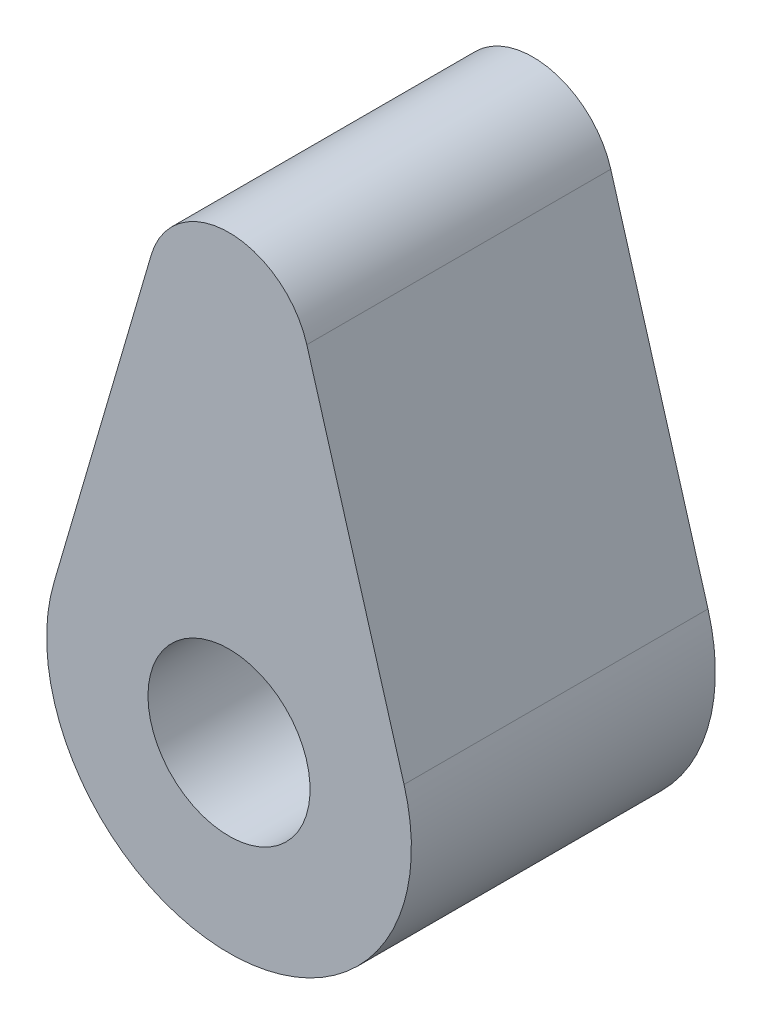
ISO-10303-21;
HEADER;
FILE_DESCRIPTION(('STEP AP214'),'2;1');
FILE_NAME('part.step','',(''),(''),'','','');
FILE_SCHEMA(('AUTOMOTIVE_DESIGN { 1 0 10303 214 1 1 1 1 }'));
ENDSEC;
DATA;
#1=APPLICATION_CONTEXT('core data for automotive mechanical design processes');
#2=APPLICATION_PROTOCOL_DEFINITION('international standard','automotive_design',2000,#1);
#3=PRODUCT_CONTEXT('',#1,'mechanical');
#4=PRODUCT('Part','Part','',(#3));
#5=PRODUCT_RELATED_PRODUCT_CATEGORY('part','',(#4));
#6=PRODUCT_DEFINITION_FORMATION('','',#4);
#7=PRODUCT_DEFINITION_CONTEXT('part definition',#1,'design');
#8=PRODUCT_DEFINITION('design','',#6,#7);
#9=PRODUCT_DEFINITION_SHAPE('','',#8);
#10=(LENGTH_UNIT() NAMED_UNIT(*) SI_UNIT(.MILLI.,.METRE.));
#11=(NAMED_UNIT(*) PLANE_ANGLE_UNIT() SI_UNIT($,.RADIAN.));
#12=(NAMED_UNIT(*) SI_UNIT($,.STERADIAN.) SOLID_ANGLE_UNIT());
#13=UNCERTAINTY_MEASURE_WITH_UNIT(LENGTH_MEASURE(1.E-05),#10,'distance_accuracy_value','');
#14=(GEOMETRIC_REPRESENTATION_CONTEXT(3) GLOBAL_UNCERTAINTY_ASSIGNED_CONTEXT((#13)) GLOBAL_UNIT_ASSIGNED_CONTEXT((#10,
#11,#12)) REPRESENTATION_CONTEXT('',''));
#15=CARTESIAN_POINT('',(0.,0.,0.));
#16=DIRECTION('',(0.,0.,1.));
#17=DIRECTION('',(1.,0.,0.));
#18=AXIS2_PLACEMENT_3D('',#15,#16,#17);
#19=CARTESIAN_POINT('',(0.,0.,0.));
#20=DIRECTION('',(0.,0.,1.));
#21=DIRECTION('',(1.,0.,0.));
#22=AXIS2_PLACEMENT_3D('',#19,#20,#21);
#23=PLANE('',#22);
#24=DIRECTION('',(-0.280898876404494,-0.959737370969107,0.));
#25=VECTOR('',#24,1.);
#26=CARTESIAN_POINT('',(-8.63763633872196,2.52808988764045,0.));
#27=LINE('',#26,#25);
#28=CARTESIAN_POINT('',(-3.83894948387643,18.923595505618,0.));
#29=VERTEX_POINT('',#28);
#30=CARTESIAN_POINT('',(-8.63763633872196,2.52808988764045,0.));
#31=VERTEX_POINT('',#30);
#32=EDGE_CURVE('E148',#29,#31,#27,.T.);
#33=ORIENTED_EDGE('',*,*,#32,.F.);
#34=CARTESIAN_POINT('',(0.,17.8,0.));
#35=DIRECTION('',(0.,0.,1.));
#36=DIRECTION('',(1.,0.,0.));
#37=AXIS2_PLACEMENT_3D('',#34,#35,#36);
#38=CIRCLE('',#37,4.);
#39=CARTESIAN_POINT('',(3.83894948387643,18.923595505618,0.));
#40=VERTEX_POINT('',#39);
#41=EDGE_CURVE('E81',#40,#29,#38,.T.);
#42=ORIENTED_EDGE('',*,*,#41,.F.);
#43=DIRECTION('',(0.280898876404494,-0.959737370969107,0.));
#44=VECTOR('',#43,1.);
#45=CARTESIAN_POINT('',(8.63763633872196,2.52808988764045,0.));
#46=LINE('',#45,#44);
#47=CARTESIAN_POINT('',(8.63763633872196,2.52808988764045,0.));
#48=VERTEX_POINT('',#47);
#49=EDGE_CURVE('E165',#40,#48,#46,.T.);
#50=ORIENTED_EDGE('',*,*,#49,.T.);
#51=CARTESIAN_POINT('',(0.,0.,0.));
#52=DIRECTION('',(0.,0.,1.));
#53=DIRECTION('',(1.,0.,0.));
#54=AXIS2_PLACEMENT_3D('',#51,#52,#53);
#55=CIRCLE('',#54,9.);
#56=EDGE_CURVE('E162',#31,#48,#55,.T.);
#57=ORIENTED_EDGE('',*,*,#56,.F.);
#58=EDGE_LOOP('',(#33,#42,#50,#57));
#59=FACE_BOUND('',#58,.T.);
#60=DIRECTION('',(-0.156434465040231,-0.987688340595138,0.));
#61=VECTOR('',#60,1.);
#62=CARTESIAN_POINT('',(-5.28662472112074,0.837319097660569,0.));
#63=LINE('',#62,#61);
#64=CARTESIAN_POINT('',(-2.6,17.8,0.));
#65=VERTEX_POINT('',#64);
#66=CARTESIAN_POINT('',(-4.73775381191881,4.30275363199531,0.));
#67=VERTEX_POINT('',#66);
#68=EDGE_CURVE('E51',#65,#67,#63,.T.);
#69=ORIENTED_EDGE('',*,*,#68,.T.);
#70=CARTESIAN_POINT('',(0.,0.,0.));
#71=DIRECTION('',(0.,0.,-1.));
#72=DIRECTION('',(-1.,0.,0.));
#73=AXIS2_PLACEMENT_3D('',#70,#71,#72);
#74=CIRCLE('',#73,6.4);
#75=CARTESIAN_POINT('',(4.73775381191881,4.30275363199531,0.));
#76=VERTEX_POINT('',#75);
#77=EDGE_CURVE('E127',#76,#67,#74,.T.);
#78=ORIENTED_EDGE('',*,*,#77,.F.);
#79=DIRECTION('',(0.156434465040231,-0.987688340595138,0.));
#80=VECTOR('',#79,1.);
#81=CARTESIAN_POINT('',(5.28662472112074,0.837319097660566,0.));
#82=LINE('',#81,#80);
#83=CARTESIAN_POINT('',(2.6,17.8,0.));
#84=VERTEX_POINT('',#83);
#85=EDGE_CURVE('E141',#84,#76,#82,.T.);
#86=ORIENTED_EDGE('',*,*,#85,.F.);
#87=CARTESIAN_POINT('',(0.,17.8,0.));
#88=DIRECTION('',(0.,0.,-1.));
#89=DIRECTION('',(-1.,0.,0.));
#90=AXIS2_PLACEMENT_3D('',#87,#88,#89);
#91=CIRCLE('',#90,2.6);
#92=EDGE_CURVE('E138',#65,#84,#91,.T.);
#93=ORIENTED_EDGE('',*,*,#92,.F.);
#94=EDGE_LOOP('',(#69,#78,#86,#93));
#95=FACE_BOUND('',#94,.T.);
#96=ADVANCED_FACE('F36',(#59,#95),#23,.F.);
#97=CARTESIAN_POINT('',(-8.63763633872196,2.52808988764045,15.));
#98=DIRECTION('',(0.959737370969107,-0.280898876404494,0.));
#99=DIRECTION('',(0.280898876404494,0.959737370969107,0.));
#100=AXIS2_PLACEMENT_3D('',#97,#98,#99);
#101=PLANE('',#100);
#102=ORIENTED_EDGE('',*,*,#32,.T.);
#103=DIRECTION('',(0.,0.,-1.));
#104=VECTOR('',#103,1.);
#105=CARTESIAN_POINT('',(-8.63763633872196,2.52808988764045,15.));
#106=LINE('',#105,#104);
#107=CARTESIAN_POINT('',(-8.63763633872196,2.52808988764045,15.));
#108=VERTEX_POINT('',#107);
#109=EDGE_CURVE('E11',#108,#31,#106,.T.);
#110=ORIENTED_EDGE('',*,*,#109,.F.);
#111=DIRECTION('',(-0.280898876404494,-0.959737370969107,0.));
#112=VECTOR('',#111,1.);
#113=CARTESIAN_POINT('',(-8.63763633872196,2.52808988764045,15.));
#114=LINE('',#113,#112);
#115=CARTESIAN_POINT('',(-3.83894948387643,18.923595505618,15.));
#116=VERTEX_POINT('',#115);
#117=EDGE_CURVE('E152',#116,#108,#114,.T.);
#118=ORIENTED_EDGE('',*,*,#117,.F.);
#119=DIRECTION('',(0.,0.,-1.));
#120=VECTOR('',#119,1.);
#121=CARTESIAN_POINT('',(-3.83894948387643,18.923595505618,15.));
#122=LINE('',#121,#120);
#123=EDGE_CURVE('E159',#116,#29,#122,.T.);
#124=ORIENTED_EDGE('',*,*,#123,.T.);
#125=EDGE_LOOP('',(#102,#110,#118,#124));
#126=FACE_BOUND('',#125,.T.);
#127=ADVANCED_FACE('F38',(#126),#101,.F.);
#128=CARTESIAN_POINT('',(0.,0.,15.));
#129=DIRECTION('',(0.,0.,-1.));
#130=DIRECTION('',(-1.,0.,0.));
#131=AXIS2_PLACEMENT_3D('',#128,#129,#130);
#132=CYLINDRICAL_SURFACE('',#131,9.);
#133=ORIENTED_EDGE('',*,*,#56,.T.);
#134=DIRECTION('',(0.,0.,-1.));
#135=VECTOR('',#134,1.);
#136=CARTESIAN_POINT('',(8.63763633872196,2.52808988764045,15.));
#137=LINE('',#136,#135);
#138=CARTESIAN_POINT('',(8.63763633872196,2.52808988764045,15.));
#139=VERTEX_POINT('',#138);
#140=EDGE_CURVE('E44',#139,#48,#137,.T.);
#141=ORIENTED_EDGE('',*,*,#140,.F.);
#142=CARTESIAN_POINT('',(0.,0.,15.));
#143=DIRECTION('',(0.,0.,1.));
#144=DIRECTION('',(1.,0.,0.));
#145=AXIS2_PLACEMENT_3D('',#142,#143,#144);
#146=CIRCLE('',#145,9.);
#147=EDGE_CURVE('E88',#108,#139,#146,.T.);
#148=ORIENTED_EDGE('',*,*,#147,.F.);
#149=ORIENTED_EDGE('',*,*,#109,.T.);
#150=EDGE_LOOP('',(#133,#141,#148,#149));
#151=FACE_BOUND('',#150,.T.);
#152=ADVANCED_FACE('F174',(#151),#132,.T.);
#153=CARTESIAN_POINT('',(8.63763633872196,2.52808988764045,15.));
#154=DIRECTION('',(0.959737370969107,0.280898876404494,0.));
#155=DIRECTION('',(-0.280898876404494,0.959737370969107,0.));
#156=AXIS2_PLACEMENT_3D('',#153,#154,#155);
#157=PLANE('',#156);
#158=ORIENTED_EDGE('',*,*,#49,.F.);
#159=DIRECTION('',(0.,0.,-1.));
#160=VECTOR('',#159,1.);
#161=CARTESIAN_POINT('',(3.83894948387643,18.923595505618,15.));
#162=LINE('',#161,#160);
#163=CARTESIAN_POINT('',(3.83894948387643,18.923595505618,15.));
#164=VERTEX_POINT('',#163);
#165=EDGE_CURVE('E170',#164,#40,#162,.T.);
#166=ORIENTED_EDGE('',*,*,#165,.F.);
#167=DIRECTION('',(0.280898876404494,-0.959737370969107,0.));
#168=VECTOR('',#167,1.);
#169=CARTESIAN_POINT('',(8.63763633872196,2.52808988764045,15.));
#170=LINE('',#169,#168);
#171=EDGE_CURVE('E155',#164,#139,#170,.T.);
#172=ORIENTED_EDGE('',*,*,#171,.T.);
#173=ORIENTED_EDGE('',*,*,#140,.T.);
#174=EDGE_LOOP('',(#158,#166,#172,#173));
#175=FACE_BOUND('',#174,.T.);
#176=ADVANCED_FACE('F173',(#175),#157,.T.);
#177=CARTESIAN_POINT('',(0.,17.8,15.));
#178=DIRECTION('',(0.,0.,-1.));
#179=DIRECTION('',(-1.,0.,0.));
#180=AXIS2_PLACEMENT_3D('',#177,#178,#179);
#181=CYLINDRICAL_SURFACE('',#180,4.);
#182=ORIENTED_EDGE('',*,*,#41,.T.);
#183=ORIENTED_EDGE('',*,*,#123,.F.);
#184=CARTESIAN_POINT('',(0.,17.8,15.));
#185=DIRECTION('',(0.,0.,1.));
#186=DIRECTION('',(1.,0.,0.));
#187=AXIS2_PLACEMENT_3D('',#184,#185,#186);
#188=CIRCLE('',#187,4.);
#189=EDGE_CURVE('E60',#164,#116,#188,.T.);
#190=ORIENTED_EDGE('',*,*,#189,.F.);
#191=ORIENTED_EDGE('',*,*,#165,.T.);
#192=EDGE_LOOP('',(#182,#183,#190,#191));
#193=FACE_BOUND('',#192,.T.);
#194=ADVANCED_FACE('F181',(#193),#181,.T.);
#195=CARTESIAN_POINT('',(0.,0.,15.));
#196=DIRECTION('',(0.,0.,1.));
#197=DIRECTION('',(1.,0.,0.));
#198=AXIS2_PLACEMENT_3D('',#195,#196,#197);
#199=PLANE('',#198);
#200=CARTESIAN_POINT('',(0.,0.,15.));
#201=DIRECTION('',(0.,0.,-1.));
#202=DIRECTION('',(-1.,0.,0.));
#203=AXIS2_PLACEMENT_3D('',#200,#201,#202);
#204=CIRCLE('',#203,4.);
#205=CARTESIAN_POINT('',(-4.,0.,15.));
#206=VERTEX_POINT('',#205);
#207=EDGE_CURVE('E287',#206,#206,#204,.T.);
#208=ORIENTED_EDGE('',*,*,#207,.T.);
#209=EDGE_LOOP('',(#208));
#210=FACE_BOUND('',#209,.T.);
#211=ORIENTED_EDGE('',*,*,#117,.T.);
#212=ORIENTED_EDGE('',*,*,#147,.T.);
#213=ORIENTED_EDGE('',*,*,#171,.F.);
#214=ORIENTED_EDGE('',*,*,#189,.T.);
#215=EDGE_LOOP('',(#211,#212,#213,#214));
#216=FACE_BOUND('',#215,.T.);
#217=ADVANCED_FACE('F182',(#210,#216),#199,.T.);
#218=CARTESIAN_POINT('',(-5.28662472112074,0.837319097660569,4.));
#219=DIRECTION('',(0.987688340595138,-0.156434465040231,0.));
#220=DIRECTION('',(0.156434465040231,0.987688340595138,0.));
#221=AXIS2_PLACEMENT_3D('',#218,#219,#220);
#222=PLANE('',#221);
#223=ORIENTED_EDGE('',*,*,#68,.F.);
#224=DIRECTION('',(0.,0.,-1.));
#225=VECTOR('',#224,1.);
#226=CARTESIAN_POINT('',(-2.6,17.8,4.));
#227=LINE('',#226,#225);
#228=CARTESIAN_POINT('',(-2.6,17.8,4.));
#229=VERTEX_POINT('',#228);
#230=EDGE_CURVE('E107',#229,#65,#227,.T.);
#231=ORIENTED_EDGE('',*,*,#230,.F.);
#232=DIRECTION('',(-0.156434465040231,-0.987688340595138,0.));
#233=VECTOR('',#232,1.);
#234=CARTESIAN_POINT('',(-5.28662472112074,0.837319097660569,4.));
#235=LINE('',#234,#233);
#236=CARTESIAN_POINT('',(-4.73775381191881,4.30275363199531,4.));
#237=VERTEX_POINT('',#236);
#238=EDGE_CURVE('E110',#229,#237,#235,.T.);
#239=ORIENTED_EDGE('',*,*,#238,.T.);
#240=DIRECTION('',(0.,0.,-1.));
#241=VECTOR('',#240,1.);
#242=CARTESIAN_POINT('',(-4.73775381191881,4.30275363199531,4.));
#243=LINE('',#242,#241);
#244=EDGE_CURVE('E146',#237,#67,#243,.T.);
#245=ORIENTED_EDGE('',*,*,#244,.T.);
#246=EDGE_LOOP('',(#223,#231,#239,#245));
#247=FACE_BOUND('',#246,.T.);
#248=ADVANCED_FACE('F109',(#247),#222,.T.);
#249=CARTESIAN_POINT('',(0.,0.,4.));
#250=DIRECTION('',(0.,0.,-1.));
#251=DIRECTION('',(-1.,0.,0.));
#252=AXIS2_PLACEMENT_3D('',#249,#250,#251);
#253=CYLINDRICAL_SURFACE('',#252,6.4);
#254=ORIENTED_EDGE('',*,*,#77,.T.);
#255=ORIENTED_EDGE('',*,*,#244,.F.);
#256=CARTESIAN_POINT('',(0.,0.,4.));
#257=DIRECTION('',(0.,0.,-1.));
#258=DIRECTION('',(-1.,0.,0.));
#259=AXIS2_PLACEMENT_3D('',#256,#257,#258);
#260=CIRCLE('',#259,6.4);
#261=CARTESIAN_POINT('',(4.73775381191881,4.30275363199531,4.));
#262=VERTEX_POINT('',#261);
#263=EDGE_CURVE('E117',#262,#237,#260,.T.);
#264=ORIENTED_EDGE('',*,*,#263,.F.);
#265=DIRECTION('',(0.,0.,-1.));
#266=VECTOR('',#265,1.);
#267=CARTESIAN_POINT('',(4.73775381191881,4.30275363199531,4.));
#268=LINE('',#267,#266);
#269=EDGE_CURVE('E149',#262,#76,#268,.T.);
#270=ORIENTED_EDGE('',*,*,#269,.T.);
#271=EDGE_LOOP('',(#254,#255,#264,#270));
#272=FACE_BOUND('',#271,.T.);
#273=ADVANCED_FACE('F190',(#272),#253,.F.);
#274=CARTESIAN_POINT('',(5.28662472112074,0.837319097660566,4.));
#275=DIRECTION('',(0.987688340595138,0.156434465040231,0.));
#276=DIRECTION('',(-0.156434465040231,0.987688340595138,0.));
#277=AXIS2_PLACEMENT_3D('',#274,#275,#276);
#278=PLANE('',#277);
#279=ORIENTED_EDGE('',*,*,#85,.T.);
#280=ORIENTED_EDGE('',*,*,#269,.F.);
#281=DIRECTION('',(0.156434465040231,-0.987688340595138,0.));
#282=VECTOR('',#281,1.);
#283=CARTESIAN_POINT('',(5.28662472112074,0.837319097660566,4.));
#284=LINE('',#283,#282);
#285=CARTESIAN_POINT('',(2.6,17.8,4.));
#286=VERTEX_POINT('',#285);
#287=EDGE_CURVE('E131',#286,#262,#284,.T.);
#288=ORIENTED_EDGE('',*,*,#287,.F.);
#289=DIRECTION('',(0.,0.,-1.));
#290=VECTOR('',#289,1.);
#291=CARTESIAN_POINT('',(2.6,17.8,4.));
#292=LINE('',#291,#290);
#293=EDGE_CURVE('E116',#286,#84,#292,.T.);
#294=ORIENTED_EDGE('',*,*,#293,.T.);
#295=EDGE_LOOP('',(#279,#280,#288,#294));
#296=FACE_BOUND('',#295,.T.);
#297=ADVANCED_FACE('F235',(#296),#278,.F.);
#298=CARTESIAN_POINT('',(0.,17.8,4.));
#299=DIRECTION('',(0.,0.,-1.));
#300=DIRECTION('',(-1.,0.,0.));
#301=AXIS2_PLACEMENT_3D('',#298,#299,#300);
#302=CYLINDRICAL_SURFACE('',#301,2.6);
#303=ORIENTED_EDGE('',*,*,#92,.T.);
#304=ORIENTED_EDGE('',*,*,#293,.F.);
#305=CARTESIAN_POINT('',(0.,17.8,4.));
#306=DIRECTION('',(0.,0.,-1.));
#307=DIRECTION('',(-1.,0.,0.));
#308=AXIS2_PLACEMENT_3D('',#305,#306,#307);
#309=CIRCLE('',#308,2.6);
#310=EDGE_CURVE('E125',#229,#286,#309,.T.);
#311=ORIENTED_EDGE('',*,*,#310,.F.);
#312=ORIENTED_EDGE('',*,*,#230,.T.);
#313=EDGE_LOOP('',(#303,#304,#311,#312));
#314=FACE_BOUND('',#313,.T.);
#315=ADVANCED_FACE('F129',(#314),#302,.F.);
#316=CARTESIAN_POINT('',(0.,0.,4.));
#317=DIRECTION('',(0.,0.,-1.));
#318=DIRECTION('',(-1.,0.,0.));
#319=AXIS2_PLACEMENT_3D('',#316,#317,#318);
#320=PLANE('',#319);
#321=ORIENTED_EDGE('',*,*,#238,.F.);
#322=ORIENTED_EDGE('',*,*,#310,.T.);
#323=ORIENTED_EDGE('',*,*,#287,.T.);
#324=ORIENTED_EDGE('',*,*,#263,.T.);
#325=EDGE_LOOP('',(#321,#322,#323,#324));
#326=FACE_BOUND('',#325,.T.);
#327=CARTESIAN_POINT('',(0.,0.,4.));
#328=DIRECTION('',(0.,0.,-1.));
#329=DIRECTION('',(-1.,0.,0.));
#330=AXIS2_PLACEMENT_3D('',#327,#328,#329);
#331=CIRCLE('',#330,4.);
#332=CARTESIAN_POINT('',(-4.,0.,4.));
#333=VERTEX_POINT('',#332);
#334=EDGE_CURVE('E139',#333,#333,#331,.T.);
#335=ORIENTED_EDGE('',*,*,#334,.F.);
#336=EDGE_LOOP('',(#335));
#337=FACE_BOUND('',#336,.T.);
#338=ADVANCED_FACE('F122',(#326,#337),#320,.T.);
#339=CARTESIAN_POINT('',(0.,0.,15.));
#340=DIRECTION('',(0.,0.,-1.));
#341=DIRECTION('',(-1.,0.,0.));
#342=AXIS2_PLACEMENT_3D('',#339,#340,#341);
#343=CYLINDRICAL_SURFACE('',#342,4.);
#344=ORIENTED_EDGE('',*,*,#334,.T.);
#345=EDGE_LOOP('',(#344));
#346=FACE_BOUND('',#345,.T.);
#347=ORIENTED_EDGE('',*,*,#207,.F.);
#348=EDGE_LOOP('',(#347));
#349=FACE_BOUND('',#348,.T.);
#350=ADVANCED_FACE('F262',(#346,#349),#343,.F.);
#351=CLOSED_SHELL('',(#96,#127,#152,#176,#194,#217,#248,#273,#297,#315,#338,#350));
#352=MANIFOLD_SOLID_BREP('B2',#351);
#353=ADVANCED_BREP_SHAPE_REPRESENTATION('',(#18,#352),#14);
#354=SHAPE_DEFINITION_REPRESENTATION(#9,#353);
ENDSEC;
END-ISO-10303-21;
